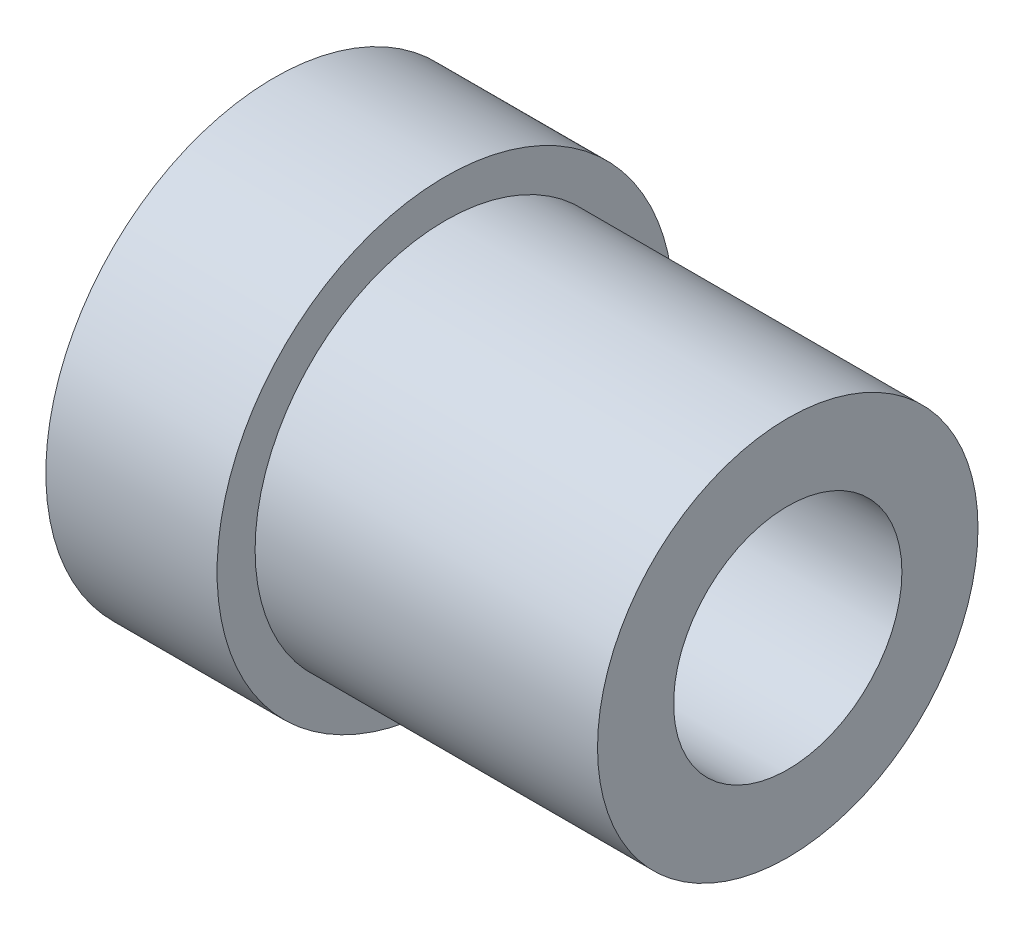
ISO-10303-21;
HEADER;
FILE_DESCRIPTION(('STEP AP214'),'2;1');
FILE_NAME('part.step','',(''),(''),'','','');
FILE_SCHEMA(('AUTOMOTIVE_DESIGN { 1 0 10303 214 1 1 1 1 }'));
ENDSEC;
DATA;
#1=APPLICATION_CONTEXT('core data for automotive mechanical design processes');
#2=APPLICATION_PROTOCOL_DEFINITION('international standard','automotive_design',2000,#1);
#3=PRODUCT_CONTEXT('',#1,'mechanical');
#4=PRODUCT('Part','Part','',(#3));
#5=PRODUCT_RELATED_PRODUCT_CATEGORY('part','',(#4));
#6=PRODUCT_DEFINITION_FORMATION('','',#4);
#7=PRODUCT_DEFINITION_CONTEXT('part definition',#1,'design');
#8=PRODUCT_DEFINITION('design','',#6,#7);
#9=PRODUCT_DEFINITION_SHAPE('','',#8);
#10=(LENGTH_UNIT() NAMED_UNIT(*) SI_UNIT(.MILLI.,.METRE.));
#11=(NAMED_UNIT(*) PLANE_ANGLE_UNIT() SI_UNIT($,.RADIAN.));
#12=(NAMED_UNIT(*) SI_UNIT($,.STERADIAN.) SOLID_ANGLE_UNIT());
#13=UNCERTAINTY_MEASURE_WITH_UNIT(LENGTH_MEASURE(1.E-05),#10,'distance_accuracy_value','');
#14=(GEOMETRIC_REPRESENTATION_CONTEXT(3) GLOBAL_UNCERTAINTY_ASSIGNED_CONTEXT((#13)) GLOBAL_UNIT_ASSIGNED_CONTEXT((#10,
#11,#12)) REPRESENTATION_CONTEXT('',''));
#15=CARTESIAN_POINT('',(0.,0.,0.));
#16=DIRECTION('',(0.,0.,1.));
#17=DIRECTION('',(1.,0.,0.));
#18=AXIS2_PLACEMENT_3D('',#15,#16,#17);
#19=CARTESIAN_POINT('',(4.5,0.,0.));
#20=DIRECTION('',(1.,0.,0.));
#21=DIRECTION('',(0.,0.,-1.));
#22=AXIS2_PLACEMENT_3D('',#19,#20,#21);
#23=PLANE('',#22);
#24=CARTESIAN_POINT('',(4.5,0.,0.));
#25=DIRECTION('',(1.,0.,0.));
#26=DIRECTION('',(0.,0.,-1.));
#27=AXIS2_PLACEMENT_3D('',#24,#25,#26);
#28=CIRCLE('',#27,5.);
#29=CARTESIAN_POINT('',(4.5,0.,-5.));
#30=VERTEX_POINT('',#29);
#31=EDGE_CURVE('E10',#30,#30,#28,.T.);
#32=ORIENTED_EDGE('',*,*,#31,.F.);
#33=EDGE_LOOP('',(#32));
#34=FACE_BOUND('',#33,.T.);
#35=CARTESIAN_POINT('',(4.5,0.,0.));
#36=DIRECTION('',(1.,0.,0.));
#37=DIRECTION('',(0.,0.,-1.));
#38=AXIS2_PLACEMENT_3D('',#35,#36,#37);
#39=CIRCLE('',#38,6.);
#40=CARTESIAN_POINT('',(4.5,0.,-6.));
#41=VERTEX_POINT('',#40);
#42=EDGE_CURVE('E46',#41,#41,#39,.T.);
#43=ORIENTED_EDGE('',*,*,#42,.T.);
#44=EDGE_LOOP('',(#43));
#45=FACE_BOUND('',#44,.T.);
#46=ADVANCED_FACE('F37',(#34,#45),#23,.T.);
#47=CARTESIAN_POINT('',(0.,0.,0.));
#48=DIRECTION('',(1.,0.,0.));
#49=DIRECTION('',(0.,0.,-1.));
#50=AXIS2_PLACEMENT_3D('',#47,#48,#49);
#51=PLANE('',#50);
#52=CARTESIAN_POINT('',(0.,0.,0.));
#53=DIRECTION('',(1.,0.,0.));
#54=DIRECTION('',(0.,0.,-1.));
#55=AXIS2_PLACEMENT_3D('',#52,#53,#54);
#56=CIRCLE('',#55,6.);
#57=CARTESIAN_POINT('',(0.,0.,-6.));
#58=VERTEX_POINT('',#57);
#59=EDGE_CURVE('E41',#58,#58,#56,.T.);
#60=ORIENTED_EDGE('',*,*,#59,.F.);
#61=EDGE_LOOP('',(#60));
#62=FACE_BOUND('',#61,.T.);
#63=CARTESIAN_POINT('',(0.,0.,0.));
#64=DIRECTION('',(1.,0.,0.));
#65=DIRECTION('',(0.,0.,-1.));
#66=AXIS2_PLACEMENT_3D('',#63,#64,#65);
#67=CIRCLE('',#66,3.);
#68=CARTESIAN_POINT('',(0.,0.,-3.));
#69=VERTEX_POINT('',#68);
#70=EDGE_CURVE('E56',#69,#69,#67,.T.);
#71=ORIENTED_EDGE('',*,*,#70,.T.);
#72=EDGE_LOOP('',(#71));
#73=FACE_BOUND('',#72,.T.);
#74=ADVANCED_FACE('F87',(#62,#73),#51,.F.);
#75=CARTESIAN_POINT('',(4.5,0.,0.));
#76=DIRECTION('',(-1.,0.,0.));
#77=DIRECTION('',(0.,0.,1.));
#78=AXIS2_PLACEMENT_3D('',#75,#76,#77);
#79=CYLINDRICAL_SURFACE('',#78,6.);
#80=ORIENTED_EDGE('',*,*,#42,.F.);
#81=EDGE_LOOP('',(#80));
#82=FACE_BOUND('',#81,.T.);
#83=ORIENTED_EDGE('',*,*,#59,.T.);
#84=EDGE_LOOP('',(#83));
#85=FACE_BOUND('',#84,.T.);
#86=ADVANCED_FACE('F39',(#82,#85),#79,.T.);
#87=CARTESIAN_POINT('',(4.5,0.,0.));
#88=DIRECTION('',(-1.,0.,0.));
#89=DIRECTION('',(0.,0.,1.));
#90=AXIS2_PLACEMENT_3D('',#87,#88,#89);
#91=CYLINDRICAL_SURFACE('',#90,3.);
#92=ORIENTED_EDGE('',*,*,#70,.F.);
#93=EDGE_LOOP('',(#92));
#94=FACE_BOUND('',#93,.T.);
#95=CARTESIAN_POINT('',(13.5,0.,0.));
#96=DIRECTION('',(1.,0.,0.));
#97=DIRECTION('',(0.,0.,-1.));
#98=AXIS2_PLACEMENT_3D('',#95,#96,#97);
#99=CIRCLE('',#98,3.);
#100=CARTESIAN_POINT('',(13.5,0.,-3.));
#101=VERTEX_POINT('',#100);
#102=EDGE_CURVE('E65',#101,#101,#99,.T.);
#103=ORIENTED_EDGE('',*,*,#102,.T.);
#104=EDGE_LOOP('',(#103));
#105=FACE_BOUND('',#104,.T.);
#106=ADVANCED_FACE('F72',(#94,#105),#91,.F.);
#107=CARTESIAN_POINT('',(13.5,0.,0.));
#108=DIRECTION('',(1.,0.,0.));
#109=DIRECTION('',(0.,0.,-1.));
#110=AXIS2_PLACEMENT_3D('',#107,#108,#109);
#111=PLANE('',#110);
#112=CARTESIAN_POINT('',(13.5,0.,0.));
#113=DIRECTION('',(1.,0.,0.));
#114=DIRECTION('',(0.,0.,-1.));
#115=AXIS2_PLACEMENT_3D('',#112,#113,#114);
#116=CIRCLE('',#115,5.);
#117=CARTESIAN_POINT('',(13.5,0.,-5.));
#118=VERTEX_POINT('',#117);
#119=EDGE_CURVE('E54',#118,#118,#116,.T.);
#120=ORIENTED_EDGE('',*,*,#119,.T.);
#121=EDGE_LOOP('',(#120));
#122=FACE_BOUND('',#121,.T.);
#123=ORIENTED_EDGE('',*,*,#102,.F.);
#124=EDGE_LOOP('',(#123));
#125=FACE_BOUND('',#124,.T.);
#126=ADVANCED_FACE('F74',(#122,#125),#111,.T.);
#127=CARTESIAN_POINT('',(13.5,0.,0.));
#128=DIRECTION('',(-1.,0.,0.));
#129=DIRECTION('',(0.,0.,1.));
#130=AXIS2_PLACEMENT_3D('',#127,#128,#129);
#131=CYLINDRICAL_SURFACE('',#130,5.);
#132=ORIENTED_EDGE('',*,*,#119,.F.);
#133=EDGE_LOOP('',(#132));
#134=FACE_BOUND('',#133,.T.);
#135=ORIENTED_EDGE('',*,*,#31,.T.);
#136=EDGE_LOOP('',(#135));
#137=FACE_BOUND('',#136,.T.);
#138=ADVANCED_FACE('F76',(#134,#137),#131,.T.);
#139=CLOSED_SHELL('',(#46,#74,#86,#106,#126,#138));
#140=MANIFOLD_SOLID_BREP('B2',#139);
#141=ADVANCED_BREP_SHAPE_REPRESENTATION('',(#18,#140),#14);
#142=SHAPE_DEFINITION_REPRESENTATION(#9,#141);
ENDSEC;
END-ISO-10303-21;
